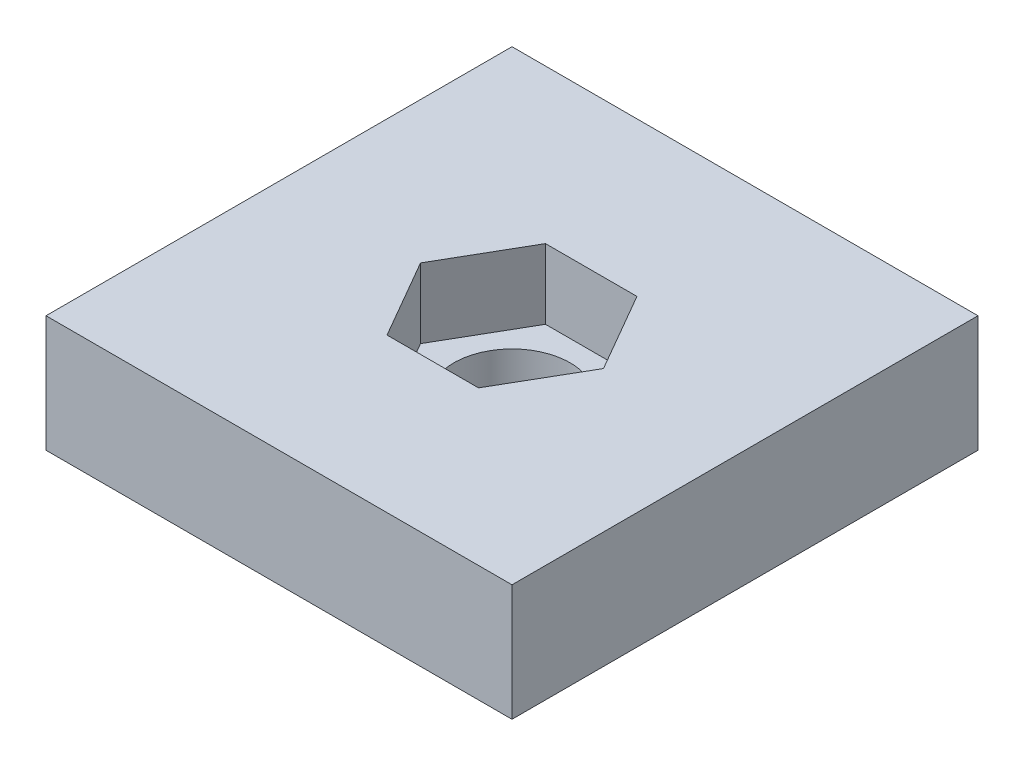
ISO-10303-21;
HEADER;
FILE_DESCRIPTION(('STEP AP214'),'2;1');
FILE_NAME('part.step','',(''),(''),'','','');
FILE_SCHEMA(('AUTOMOTIVE_DESIGN { 1 0 10303 214 1 1 1 1 }'));
ENDSEC;
DATA;
#1=APPLICATION_CONTEXT('core data for automotive mechanical design processes');
#2=APPLICATION_PROTOCOL_DEFINITION('international standard','automotive_design',2000,#1);
#3=PRODUCT_CONTEXT('',#1,'mechanical');
#4=PRODUCT('Part','Part','',(#3));
#5=PRODUCT_RELATED_PRODUCT_CATEGORY('part','',(#4));
#6=PRODUCT_DEFINITION_FORMATION('','',#4);
#7=PRODUCT_DEFINITION_CONTEXT('part definition',#1,'design');
#8=PRODUCT_DEFINITION('design','',#6,#7);
#9=PRODUCT_DEFINITION_SHAPE('','',#8);
#10=(LENGTH_UNIT() NAMED_UNIT(*) SI_UNIT(.MILLI.,.METRE.));
#11=(NAMED_UNIT(*) PLANE_ANGLE_UNIT() SI_UNIT($,.RADIAN.));
#12=(NAMED_UNIT(*) SI_UNIT($,.STERADIAN.) SOLID_ANGLE_UNIT());
#13=UNCERTAINTY_MEASURE_WITH_UNIT(LENGTH_MEASURE(1.E-05),#10,'distance_accuracy_value','');
#14=(GEOMETRIC_REPRESENTATION_CONTEXT(3) GLOBAL_UNCERTAINTY_ASSIGNED_CONTEXT((#13)) GLOBAL_UNIT_ASSIGNED_CONTEXT((#10,
#11,#12)) REPRESENTATION_CONTEXT('',''));
#15=CARTESIAN_POINT('',(0.,0.,0.));
#16=DIRECTION('',(0.,0.,1.));
#17=DIRECTION('',(1.,0.,0.));
#18=AXIS2_PLACEMENT_3D('',#15,#16,#17);
#19=CARTESIAN_POINT('',(10.,5.,10.));
#20=DIRECTION('',(-1.,0.,0.));
#21=DIRECTION('',(0.,0.,1.));
#22=AXIS2_PLACEMENT_3D('',#19,#20,#21);
#23=PLANE('',#22);
#24=DIRECTION('',(0.,0.,-1.));
#25=VECTOR('',#24,1.);
#26=CARTESIAN_POINT('',(10.,0.,10.));
#27=LINE('',#26,#25);
#28=CARTESIAN_POINT('',(10.,0.,10.));
#29=VERTEX_POINT('',#28);
#30=CARTESIAN_POINT('',(10.,0.,-10.));
#31=VERTEX_POINT('',#30);
#32=EDGE_CURVE('E190',#29,#31,#27,.T.);
#33=ORIENTED_EDGE('',*,*,#32,.T.);
#34=DIRECTION('',(0.,-1.,0.));
#35=VECTOR('',#34,1.);
#36=CARTESIAN_POINT('',(10.,5.,-10.));
#37=LINE('',#36,#35);
#38=CARTESIAN_POINT('',(10.,5.,-10.));
#39=VERTEX_POINT('',#38);
#40=EDGE_CURVE('E11',#39,#31,#37,.T.);
#41=ORIENTED_EDGE('',*,*,#40,.F.);
#42=DIRECTION('',(0.,0.,-1.));
#43=VECTOR('',#42,1.);
#44=CARTESIAN_POINT('',(10.,5.,10.));
#45=LINE('',#44,#43);
#46=CARTESIAN_POINT('',(10.,5.,10.));
#47=VERTEX_POINT('',#46);
#48=EDGE_CURVE('E202',#47,#39,#45,.T.);
#49=ORIENTED_EDGE('',*,*,#48,.F.);
#50=DIRECTION('',(0.,-1.,0.));
#51=VECTOR('',#50,1.);
#52=CARTESIAN_POINT('',(10.,5.,10.));
#53=LINE('',#52,#51);
#54=EDGE_CURVE('E212',#47,#29,#53,.T.);
#55=ORIENTED_EDGE('',*,*,#54,.T.);
#56=EDGE_LOOP('',(#33,#41,#49,#55));
#57=FACE_BOUND('',#56,.T.);
#58=ADVANCED_FACE('F39',(#57),#23,.F.);
#59=CARTESIAN_POINT('',(-10.,5.,-10.));
#60=DIRECTION('',(0.,0.,1.));
#61=DIRECTION('',(1.,0.,0.));
#62=AXIS2_PLACEMENT_3D('',#59,#60,#61);
#63=PLANE('',#62);
#64=DIRECTION('',(-1.,0.,0.));
#65=VECTOR('',#64,1.);
#66=CARTESIAN_POINT('',(-10.,0.,-10.));
#67=LINE('',#66,#65);
#68=CARTESIAN_POINT('',(-10.,0.,-10.));
#69=VERTEX_POINT('',#68);
#70=EDGE_CURVE('E216',#31,#69,#67,.T.);
#71=ORIENTED_EDGE('',*,*,#70,.T.);
#72=DIRECTION('',(0.,-1.,0.));
#73=VECTOR('',#72,1.);
#74=CARTESIAN_POINT('',(-10.,5.,-10.));
#75=LINE('',#74,#73);
#76=CARTESIAN_POINT('',(-10.,5.,-10.));
#77=VERTEX_POINT('',#76);
#78=EDGE_CURVE('E47',#77,#69,#75,.T.);
#79=ORIENTED_EDGE('',*,*,#78,.F.);
#80=DIRECTION('',(-1.,0.,0.));
#81=VECTOR('',#80,1.);
#82=CARTESIAN_POINT('',(-10.,5.,-10.));
#83=LINE('',#82,#81);
#84=EDGE_CURVE('E91',#39,#77,#83,.T.);
#85=ORIENTED_EDGE('',*,*,#84,.F.);
#86=ORIENTED_EDGE('',*,*,#40,.T.);
#87=EDGE_LOOP('',(#71,#79,#85,#86));
#88=FACE_BOUND('',#87,.T.);
#89=ADVANCED_FACE('F251',(#88),#63,.F.);
#90=CARTESIAN_POINT('',(-10.,5.,10.));
#91=DIRECTION('',(1.,0.,0.));
#92=DIRECTION('',(0.,0.,-1.));
#93=AXIS2_PLACEMENT_3D('',#90,#91,#92);
#94=PLANE('',#93);
#95=DIRECTION('',(0.,0.,1.));
#96=VECTOR('',#95,1.);
#97=CARTESIAN_POINT('',(-10.,0.,10.));
#98=LINE('',#97,#96);
#99=CARTESIAN_POINT('',(-10.,0.,10.));
#100=VERTEX_POINT('',#99);
#101=EDGE_CURVE('E219',#69,#100,#98,.T.);
#102=ORIENTED_EDGE('',*,*,#101,.T.);
#103=DIRECTION('',(0.,-1.,0.));
#104=VECTOR('',#103,1.);
#105=CARTESIAN_POINT('',(-10.,5.,10.));
#106=LINE('',#105,#104);
#107=CARTESIAN_POINT('',(-10.,5.,10.));
#108=VERTEX_POINT('',#107);
#109=EDGE_CURVE('E226',#108,#100,#106,.T.);
#110=ORIENTED_EDGE('',*,*,#109,.F.);
#111=DIRECTION('',(0.,0.,1.));
#112=VECTOR('',#111,1.);
#113=CARTESIAN_POINT('',(-10.,5.,10.));
#114=LINE('',#113,#112);
#115=EDGE_CURVE('E207',#77,#108,#114,.T.);
#116=ORIENTED_EDGE('',*,*,#115,.F.);
#117=ORIENTED_EDGE('',*,*,#78,.T.);
#118=EDGE_LOOP('',(#102,#110,#116,#117));
#119=FACE_BOUND('',#118,.T.);
#120=ADVANCED_FACE('F233',(#119),#94,.F.);
#121=CARTESIAN_POINT('',(-10.,5.,10.));
#122=DIRECTION('',(0.,0.,-1.));
#123=DIRECTION('',(-1.,0.,0.));
#124=AXIS2_PLACEMENT_3D('',#121,#122,#123);
#125=PLANE('',#124);
#126=DIRECTION('',(1.,0.,0.));
#127=VECTOR('',#126,1.);
#128=CARTESIAN_POINT('',(-10.,0.,10.));
#129=LINE('',#128,#127);
#130=EDGE_CURVE('E84',#100,#29,#129,.T.);
#131=ORIENTED_EDGE('',*,*,#130,.T.);
#132=ORIENTED_EDGE('',*,*,#54,.F.);
#133=DIRECTION('',(1.,0.,0.));
#134=VECTOR('',#133,1.);
#135=CARTESIAN_POINT('',(-10.,5.,10.));
#136=LINE('',#135,#134);
#137=EDGE_CURVE('E63',#108,#47,#136,.T.);
#138=ORIENTED_EDGE('',*,*,#137,.F.);
#139=ORIENTED_EDGE('',*,*,#109,.T.);
#140=EDGE_LOOP('',(#131,#132,#138,#139));
#141=FACE_BOUND('',#140,.T.);
#142=ADVANCED_FACE('F241',(#141),#125,.F.);
#143=CARTESIAN_POINT('',(0.,5.,0.));
#144=DIRECTION('',(0.,-1.,0.));
#145=DIRECTION('',(0.,0.,-1.));
#146=AXIS2_PLACEMENT_3D('',#143,#144,#145);
#147=PLANE('',#146);
#148=DIRECTION('',(-0.5,0.,-0.866025403784438));
#149=VECTOR('',#148,1.);
#150=CARTESIAN_POINT('',(3.92598183048946,5.,0.));
#151=LINE('',#150,#149);
#152=CARTESIAN_POINT('',(3.92598183048946,5.,0.));
#153=VERTEX_POINT('',#152);
#154=CARTESIAN_POINT('',(1.96299091524473,5.,-3.4));
#155=VERTEX_POINT('',#154);
#156=EDGE_CURVE('E172',#153,#155,#151,.T.);
#157=ORIENTED_EDGE('',*,*,#156,.F.);
#158=DIRECTION('',(0.5,0.,-0.866025403784439));
#159=VECTOR('',#158,1.);
#160=CARTESIAN_POINT('',(1.96299091524473,5.,3.4));
#161=LINE('',#160,#159);
#162=CARTESIAN_POINT('',(1.96299091524473,5.,3.4));
#163=VERTEX_POINT('',#162);
#164=EDGE_CURVE('E54',#163,#153,#161,.T.);
#165=ORIENTED_EDGE('',*,*,#164,.F.);
#166=DIRECTION('',(1.,0.,0.));
#167=VECTOR('',#166,1.);
#168=CARTESIAN_POINT('',(-1.96299091524473,5.,3.4));
#169=LINE('',#168,#167);
#170=CARTESIAN_POINT('',(-1.96299091524473,5.,3.4));
#171=VERTEX_POINT('',#170);
#172=EDGE_CURVE('E149',#171,#163,#169,.T.);
#173=ORIENTED_EDGE('',*,*,#172,.F.);
#174=DIRECTION('',(0.5,0.,0.866025403784439));
#175=VECTOR('',#174,1.);
#176=CARTESIAN_POINT('',(-3.92598183048946,5.,0.));
#177=LINE('',#176,#175);
#178=CARTESIAN_POINT('',(-3.92598183048946,5.,0.));
#179=VERTEX_POINT('',#178);
#180=EDGE_CURVE('E153',#179,#171,#177,.T.);
#181=ORIENTED_EDGE('',*,*,#180,.F.);
#182=DIRECTION('',(-0.5,0.,0.866025403784439));
#183=VECTOR('',#182,1.);
#184=CARTESIAN_POINT('',(-1.96299091524473,5.,-3.4));
#185=LINE('',#184,#183);
#186=CARTESIAN_POINT('',(-1.96299091524473,5.,-3.4));
#187=VERTEX_POINT('',#186);
#188=EDGE_CURVE('E180',#187,#179,#185,.T.);
#189=ORIENTED_EDGE('',*,*,#188,.F.);
#190=DIRECTION('',(-1.,0.,0.));
#191=VECTOR('',#190,1.);
#192=CARTESIAN_POINT('',(1.96299091524473,5.,-3.4));
#193=LINE('',#192,#191);
#194=EDGE_CURVE('E176',#155,#187,#193,.T.);
#195=ORIENTED_EDGE('',*,*,#194,.F.);
#196=EDGE_LOOP('',(#157,#165,#173,#181,#189,#195));
#197=FACE_BOUND('',#196,.T.);
#198=ORIENTED_EDGE('',*,*,#48,.T.);
#199=ORIENTED_EDGE('',*,*,#84,.T.);
#200=ORIENTED_EDGE('',*,*,#115,.T.);
#201=ORIENTED_EDGE('',*,*,#137,.T.);
#202=EDGE_LOOP('',(#198,#199,#200,#201));
#203=FACE_BOUND('',#202,.T.);
#204=ADVANCED_FACE('F243',(#197,#203),#147,.F.);
#205=CARTESIAN_POINT('',(0.,0.,0.));
#206=DIRECTION('',(0.,-1.,0.));
#207=DIRECTION('',(0.,0.,-1.));
#208=AXIS2_PLACEMENT_3D('',#205,#206,#207);
#209=PLANE('',#208);
#210=CARTESIAN_POINT('',(0.,0.,0.));
#211=DIRECTION('',(0.,1.,0.));
#212=DIRECTION('',(0.,0.,1.));
#213=AXIS2_PLACEMENT_3D('',#210,#211,#212);
#214=CIRCLE('',#213,2.5);
#215=CARTESIAN_POINT('',(0.,0.,2.5));
#216=VERTEX_POINT('',#215);
#217=EDGE_CURVE('E173',#216,#216,#214,.T.);
#218=ORIENTED_EDGE('',*,*,#217,.T.);
#219=EDGE_LOOP('',(#218));
#220=FACE_BOUND('',#219,.T.);
#221=ORIENTED_EDGE('',*,*,#32,.F.);
#222=ORIENTED_EDGE('',*,*,#130,.F.);
#223=ORIENTED_EDGE('',*,*,#101,.F.);
#224=ORIENTED_EDGE('',*,*,#70,.F.);
#225=EDGE_LOOP('',(#221,#222,#223,#224));
#226=FACE_BOUND('',#225,.T.);
#227=ADVANCED_FACE('F237',(#220,#226),#209,.T.);
#228=CARTESIAN_POINT('',(1.96299091524473,2.,3.4));
#229=DIRECTION('',(0.866025403784439,0.,0.5));
#230=DIRECTION('',(0.5,0.,-0.866025403784439));
#231=AXIS2_PLACEMENT_3D('',#228,#229,#230);
#232=PLANE('',#231);
#233=ORIENTED_EDGE('',*,*,#164,.T.);
#234=DIRECTION('',(0.,1.,0.));
#235=VECTOR('',#234,1.);
#236=CARTESIAN_POINT('',(3.92598183048946,2.,0.));
#237=LINE('',#236,#235);
#238=CARTESIAN_POINT('',(3.92598183048946,2.,0.));
#239=VERTEX_POINT('',#238);
#240=EDGE_CURVE('E123',#239,#153,#237,.T.);
#241=ORIENTED_EDGE('',*,*,#240,.F.);
#242=DIRECTION('',(0.5,0.,-0.866025403784439));
#243=VECTOR('',#242,1.);
#244=CARTESIAN_POINT('',(1.96299091524473,2.,3.4));
#245=LINE('',#244,#243);
#246=CARTESIAN_POINT('',(1.96299091524473,2.,3.4));
#247=VERTEX_POINT('',#246);
#248=EDGE_CURVE('E127',#247,#239,#245,.T.);
#249=ORIENTED_EDGE('',*,*,#248,.F.);
#250=DIRECTION('',(0.,1.,0.));
#251=VECTOR('',#250,1.);
#252=CARTESIAN_POINT('',(1.96299091524473,2.,3.4));
#253=LINE('',#252,#251);
#254=EDGE_CURVE('E187',#247,#163,#253,.T.);
#255=ORIENTED_EDGE('',*,*,#254,.T.);
#256=EDGE_LOOP('',(#233,#241,#249,#255));
#257=FACE_BOUND('',#256,.T.);
#258=ADVANCED_FACE('F125',(#257),#232,.F.);
#259=CARTESIAN_POINT('',(-1.96299091524473,2.,3.4));
#260=DIRECTION('',(0.,0.,1.));
#261=DIRECTION('',(1.,0.,0.));
#262=AXIS2_PLACEMENT_3D('',#259,#260,#261);
#263=PLANE('',#262);
#264=ORIENTED_EDGE('',*,*,#172,.T.);
#265=ORIENTED_EDGE('',*,*,#254,.F.);
#266=DIRECTION('',(1.,0.,0.));
#267=VECTOR('',#266,1.);
#268=CARTESIAN_POINT('',(-1.96299091524473,2.,3.4));
#269=LINE('',#268,#267);
#270=CARTESIAN_POINT('',(-1.96299091524473,2.,3.4));
#271=VERTEX_POINT('',#270);
#272=EDGE_CURVE('E134',#271,#247,#269,.T.);
#273=ORIENTED_EDGE('',*,*,#272,.F.);
#274=DIRECTION('',(0.,1.,0.));
#275=VECTOR('',#274,1.);
#276=CARTESIAN_POINT('',(-1.96299091524473,2.,3.4));
#277=LINE('',#276,#275);
#278=EDGE_CURVE('E191',#271,#171,#277,.T.);
#279=ORIENTED_EDGE('',*,*,#278,.T.);
#280=EDGE_LOOP('',(#264,#265,#273,#279));
#281=FACE_BOUND('',#280,.T.);
#282=ADVANCED_FACE('F285',(#281),#263,.F.);
#283=CARTESIAN_POINT('',(-3.92598183048946,2.,0.));
#284=DIRECTION('',(-0.866025403784439,0.,0.5));
#285=DIRECTION('',(0.5,0.,0.866025403784439));
#286=AXIS2_PLACEMENT_3D('',#283,#284,#285);
#287=PLANE('',#286);
#288=ORIENTED_EDGE('',*,*,#180,.T.);
#289=ORIENTED_EDGE('',*,*,#278,.F.);
#290=DIRECTION('',(0.5,0.,0.866025403784439));
#291=VECTOR('',#290,1.);
#292=CARTESIAN_POINT('',(-3.92598183048946,2.,0.));
#293=LINE('',#292,#291);
#294=CARTESIAN_POINT('',(-3.92598183048946,2.,0.));
#295=VERTEX_POINT('',#294);
#296=EDGE_CURVE('E165',#295,#271,#293,.T.);
#297=ORIENTED_EDGE('',*,*,#296,.F.);
#298=DIRECTION('',(0.,1.,0.));
#299=VECTOR('',#298,1.);
#300=CARTESIAN_POINT('',(-3.92598183048946,2.,0.));
#301=LINE('',#300,#299);
#302=EDGE_CURVE('E194',#295,#179,#301,.T.);
#303=ORIENTED_EDGE('',*,*,#302,.T.);
#304=EDGE_LOOP('',(#288,#289,#297,#303));
#305=FACE_BOUND('',#304,.T.);
#306=ADVANCED_FACE('F294',(#305),#287,.F.);
#307=CARTESIAN_POINT('',(-1.96299091524473,2.,-3.4));
#308=DIRECTION('',(-0.866025403784439,0.,-0.5));
#309=DIRECTION('',(-0.5,0.,0.866025403784439));
#310=AXIS2_PLACEMENT_3D('',#307,#308,#309);
#311=PLANE('',#310);
#312=ORIENTED_EDGE('',*,*,#188,.T.);
#313=ORIENTED_EDGE('',*,*,#302,.F.);
#314=DIRECTION('',(-0.5,0.,0.866025403784439));
#315=VECTOR('',#314,1.);
#316=CARTESIAN_POINT('',(-1.96299091524473,2.,-3.4));
#317=LINE('',#316,#315);
#318=CARTESIAN_POINT('',(-1.96299091524473,2.,-3.4));
#319=VERTEX_POINT('',#318);
#320=EDGE_CURVE('E161',#319,#295,#317,.T.);
#321=ORIENTED_EDGE('',*,*,#320,.F.);
#322=DIRECTION('',(0.,1.,0.));
#323=VECTOR('',#322,1.);
#324=CARTESIAN_POINT('',(-1.96299091524473,2.,-3.4));
#325=LINE('',#324,#323);
#326=EDGE_CURVE('E197',#319,#187,#325,.T.);
#327=ORIENTED_EDGE('',*,*,#326,.T.);
#328=EDGE_LOOP('',(#312,#313,#321,#327));
#329=FACE_BOUND('',#328,.T.);
#330=ADVANCED_FACE('F304',(#329),#311,.F.);
#331=CARTESIAN_POINT('',(1.96299091524473,2.,-3.4));
#332=DIRECTION('',(0.,0.,-1.));
#333=DIRECTION('',(-1.,0.,0.));
#334=AXIS2_PLACEMENT_3D('',#331,#332,#333);
#335=PLANE('',#334);
#336=ORIENTED_EDGE('',*,*,#194,.T.);
#337=ORIENTED_EDGE('',*,*,#326,.F.);
#338=DIRECTION('',(-1.,0.,0.));
#339=VECTOR('',#338,1.);
#340=CARTESIAN_POINT('',(1.96299091524473,2.,-3.4));
#341=LINE('',#340,#339);
#342=CARTESIAN_POINT('',(1.96299091524473,2.,-3.4));
#343=VERTEX_POINT('',#342);
#344=EDGE_CURVE('E143',#343,#319,#341,.T.);
#345=ORIENTED_EDGE('',*,*,#344,.F.);
#346=DIRECTION('',(0.,1.,0.));
#347=VECTOR('',#346,1.);
#348=CARTESIAN_POINT('',(1.96299091524473,2.,-3.4));
#349=LINE('',#348,#347);
#350=EDGE_CURVE('E133',#343,#155,#349,.T.);
#351=ORIENTED_EDGE('',*,*,#350,.T.);
#352=EDGE_LOOP('',(#336,#337,#345,#351));
#353=FACE_BOUND('',#352,.T.);
#354=ADVANCED_FACE('F314',(#353),#335,.F.);
#355=CARTESIAN_POINT('',(3.92598183048946,2.,0.));
#356=DIRECTION('',(0.866025403784438,0.,-0.5));
#357=DIRECTION('',(-0.5,0.,-0.866025403784439));
#358=AXIS2_PLACEMENT_3D('',#355,#356,#357);
#359=PLANE('',#358);
#360=ORIENTED_EDGE('',*,*,#156,.T.);
#361=ORIENTED_EDGE('',*,*,#350,.F.);
#362=DIRECTION('',(-0.5,0.,-0.866025403784438));
#363=VECTOR('',#362,1.);
#364=CARTESIAN_POINT('',(3.92598183048946,2.,0.));
#365=LINE('',#364,#363);
#366=EDGE_CURVE('E137',#239,#343,#365,.T.);
#367=ORIENTED_EDGE('',*,*,#366,.F.);
#368=ORIENTED_EDGE('',*,*,#240,.T.);
#369=EDGE_LOOP('',(#360,#361,#367,#368));
#370=FACE_BOUND('',#369,.T.);
#371=ADVANCED_FACE('F138',(#370),#359,.F.);
#372=CARTESIAN_POINT('',(0.,2.,0.));
#373=DIRECTION('',(0.,1.,0.));
#374=DIRECTION('',(0.,0.,1.));
#375=AXIS2_PLACEMENT_3D('',#372,#373,#374);
#376=PLANE('',#375);
#377=CARTESIAN_POINT('',(0.,2.,0.));
#378=DIRECTION('',(0.,1.,0.));
#379=DIRECTION('',(0.,0.,1.));
#380=AXIS2_PLACEMENT_3D('',#377,#378,#379);
#381=CIRCLE('',#380,2.5);
#382=CARTESIAN_POINT('',(0.,2.,2.5));
#383=VERTEX_POINT('',#382);
#384=EDGE_CURVE('E156',#383,#383,#381,.T.);
#385=ORIENTED_EDGE('',*,*,#384,.F.);
#386=EDGE_LOOP('',(#385));
#387=FACE_BOUND('',#386,.T.);
#388=ORIENTED_EDGE('',*,*,#248,.T.);
#389=ORIENTED_EDGE('',*,*,#366,.T.);
#390=ORIENTED_EDGE('',*,*,#344,.T.);
#391=ORIENTED_EDGE('',*,*,#320,.T.);
#392=ORIENTED_EDGE('',*,*,#296,.T.);
#393=ORIENTED_EDGE('',*,*,#272,.T.);
#394=EDGE_LOOP('',(#388,#389,#390,#391,#392,#393));
#395=FACE_BOUND('',#394,.T.);
#396=ADVANCED_FACE('F145',(#387,#395),#376,.T.);
#397=CARTESIAN_POINT('',(0.,0.,0.));
#398=DIRECTION('',(0.,1.,0.));
#399=DIRECTION('',(0.,0.,1.));
#400=AXIS2_PLACEMENT_3D('',#397,#398,#399);
#401=CYLINDRICAL_SURFACE('',#400,2.5);
#402=ORIENTED_EDGE('',*,*,#217,.F.);
#403=EDGE_LOOP('',(#402));
#404=FACE_BOUND('',#403,.T.);
#405=ORIENTED_EDGE('',*,*,#384,.T.);
#406=EDGE_LOOP('',(#405));
#407=FACE_BOUND('',#406,.T.);
#408=ADVANCED_FACE('F347',(#404,#407),#401,.F.);
#409=CLOSED_SHELL('',(#58,#89,#120,#142,#204,#227,#258,#282,#306,#330,#354,#371,#396,#408));
#410=MANIFOLD_SOLID_BREP('B2',#409);
#411=ADVANCED_BREP_SHAPE_REPRESENTATION('',(#18,#410),#14);
#412=SHAPE_DEFINITION_REPRESENTATION(#9,#411);
ENDSEC;
END-ISO-10303-21;
